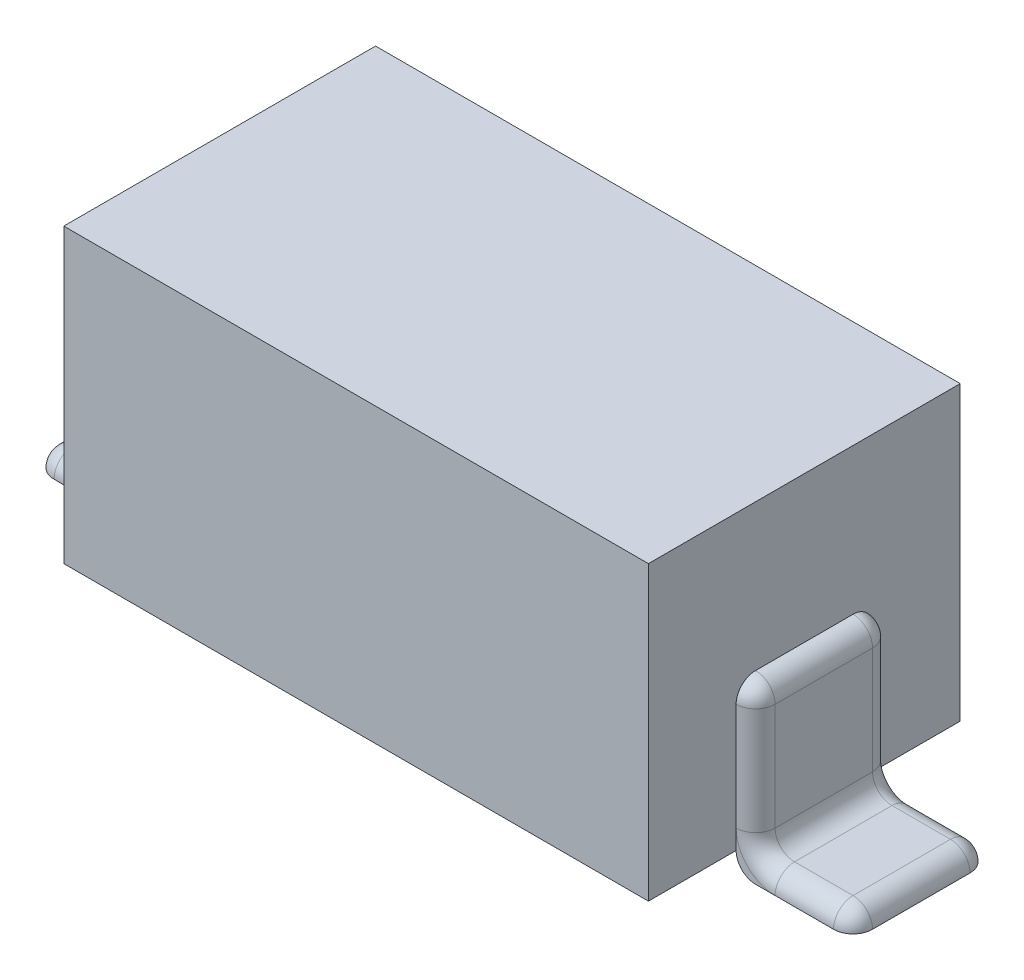
ISO-10303-21;
HEADER;
FILE_DESCRIPTION(('STEP AP214'),'2;1');
FILE_NAME('part.step','',(''),(''),'','','');
FILE_SCHEMA(('AUTOMOTIVE_DESIGN { 1 0 10303 214 1 1 1 1 }'));
ENDSEC;
DATA;
#1=APPLICATION_CONTEXT('core data for automotive mechanical design processes');
#2=APPLICATION_PROTOCOL_DEFINITION('international standard','automotive_design',2000,#1);
#3=PRODUCT_CONTEXT('',#1,'mechanical');
#4=PRODUCT('Part','Part','',(#3));
#5=PRODUCT_RELATED_PRODUCT_CATEGORY('part','',(#4));
#6=PRODUCT_DEFINITION_FORMATION('','',#4);
#7=PRODUCT_DEFINITION_CONTEXT('part definition',#1,'design');
#8=PRODUCT_DEFINITION('design','',#6,#7);
#9=PRODUCT_DEFINITION_SHAPE('','',#8);
#10=(LENGTH_UNIT() NAMED_UNIT(*) SI_UNIT(.MILLI.,.METRE.));
#11=(NAMED_UNIT(*) PLANE_ANGLE_UNIT() SI_UNIT($,.RADIAN.));
#12=(NAMED_UNIT(*) SI_UNIT($,.STERADIAN.) SOLID_ANGLE_UNIT());
#13=UNCERTAINTY_MEASURE_WITH_UNIT(LENGTH_MEASURE(1.E-05),#10,'distance_accuracy_value','');
#14=(GEOMETRIC_REPRESENTATION_CONTEXT(3) GLOBAL_UNCERTAINTY_ASSIGNED_CONTEXT((#13)) GLOBAL_UNIT_ASSIGNED_CONTEXT((#10,
#11,#12)) REPRESENTATION_CONTEXT('',''));
#15=CARTESIAN_POINT('',(0.,0.,0.));
#16=DIRECTION('',(0.,0.,1.));
#17=DIRECTION('',(1.,0.,0.));
#18=AXIS2_PLACEMENT_3D('',#15,#16,#17);
#19=CARTESIAN_POINT('',(-1.6,-0.85,0.35));
#20=DIRECTION('',(0.,0.,1.));
#21=DIRECTION('',(1.,0.,0.));
#22=AXIS2_PLACEMENT_3D('',#19,#20,#21);
#23=PLANE('',#22);
#24=DIRECTION('',(1.,0.,0.));
#25=VECTOR('',#24,1.);
#26=CARTESIAN_POINT('',(-1.6,-0.85,0.35));
#27=LINE('',#26,#25);
#28=CARTESIAN_POINT('',(-1.7,-0.85,0.35));
#29=VERTEX_POINT('',#28);
#30=CARTESIAN_POINT('',(-1.6,-0.85,0.35));
#31=VERTEX_POINT('',#30);
#32=EDGE_CURVE('E303',#29,#31,#27,.T.);
#33=ORIENTED_EDGE('',*,*,#32,.T.);
#34=CARTESIAN_POINT('',(-1.6,-0.75,0.35));
#35=DIRECTION('',(0.,0.,1.));
#36=DIRECTION('',(1.,0.,0.));
#37=AXIS2_PLACEMENT_3D('',#34,#35,#36);
#38=CIRCLE('',#37,0.1);
#39=CARTESIAN_POINT('',(-1.5,-0.75,0.35));
#40=VERTEX_POINT('',#39);
#41=EDGE_CURVE('E374',#31,#40,#38,.T.);
#42=ORIENTED_EDGE('',*,*,#41,.T.);
#43=DIRECTION('',(0.,-1.,0.));
#44=VECTOR('',#43,1.);
#45=CARTESIAN_POINT('',(-1.5,-0.85,0.35));
#46=LINE('',#45,#44);
#47=CARTESIAN_POINT('',(-1.5,-0.65,0.35));
#48=VERTEX_POINT('',#47);
#49=EDGE_CURVE('E308',#48,#40,#46,.T.);
#50=ORIENTED_EDGE('',*,*,#49,.F.);
#51=CARTESIAN_POINT('',(-1.7,-0.65,0.35));
#52=DIRECTION('',(0.,0.,1.));
#53=DIRECTION('',(1.,0.,0.));
#54=AXIS2_PLACEMENT_3D('',#51,#52,#53);
#55=CIRCLE('',#54,0.2);
#56=EDGE_CURVE('E376',#29,#48,#55,.T.);
#57=ORIENTED_EDGE('',*,*,#56,.F.);
#58=EDGE_LOOP('',(#33,#42,#50,#57));
#59=FACE_BOUND('',#58,.T.);
#60=ADVANCED_FACE('F34',(#59),#23,.T.);
#61=CARTESIAN_POINT('',(-1.6,-0.85,-0.35));
#62=DIRECTION('',(0.,0.,-1.));
#63=DIRECTION('',(-1.,0.,0.));
#64=AXIS2_PLACEMENT_3D('',#61,#62,#63);
#65=PLANE('',#64);
#66=CARTESIAN_POINT('',(-1.7,-0.65,-0.35));
#67=DIRECTION('',(0.,0.,-1.));
#68=DIRECTION('',(-1.,0.,0.));
#69=AXIS2_PLACEMENT_3D('',#66,#67,#68);
#70=CIRCLE('',#69,0.2);
#71=CARTESIAN_POINT('',(-1.5,-0.65,-0.35));
#72=VERTEX_POINT('',#71);
#73=CARTESIAN_POINT('',(-1.7,-0.85,-0.35));
#74=VERTEX_POINT('',#73);
#75=EDGE_CURVE('E226',#72,#74,#70,.T.);
#76=ORIENTED_EDGE('',*,*,#75,.F.);
#77=DIRECTION('',(0.,1.,0.));
#78=VECTOR('',#77,1.);
#79=CARTESIAN_POINT('',(-1.5,-0.85,-0.35));
#80=LINE('',#79,#78);
#81=CARTESIAN_POINT('',(-1.5,-0.75,-0.35));
#82=VERTEX_POINT('',#81);
#83=EDGE_CURVE('E227',#82,#72,#80,.T.);
#84=ORIENTED_EDGE('',*,*,#83,.F.);
#85=CARTESIAN_POINT('',(-1.6,-0.75,-0.35));
#86=DIRECTION('',(0.,0.,-1.));
#87=DIRECTION('',(-1.,0.,0.));
#88=AXIS2_PLACEMENT_3D('',#85,#86,#87);
#89=CIRCLE('',#88,0.1);
#90=CARTESIAN_POINT('',(-1.6,-0.85,-0.35));
#91=VERTEX_POINT('',#90);
#92=EDGE_CURVE('E217',#82,#91,#89,.T.);
#93=ORIENTED_EDGE('',*,*,#92,.T.);
#94=DIRECTION('',(1.,0.,0.));
#95=VECTOR('',#94,1.);
#96=CARTESIAN_POINT('',(-1.6,-0.85,-0.35));
#97=LINE('',#96,#95);
#98=EDGE_CURVE('E299',#74,#91,#97,.T.);
#99=ORIENTED_EDGE('',*,*,#98,.F.);
#100=EDGE_LOOP('',(#76,#84,#93,#99));
#101=FACE_BOUND('',#100,.T.);
#102=ADVANCED_FACE('F230',(#101),#65,.T.);
#103=CARTESIAN_POINT('',(1.6,-0.85,0.35));
#104=DIRECTION('',(0.,0.,-1.));
#105=DIRECTION('',(-1.,0.,0.));
#106=AXIS2_PLACEMENT_3D('',#103,#104,#105);
#107=PLANE('',#106);
#108=CARTESIAN_POINT('',(1.7,-0.65,0.35));
#109=DIRECTION('',(0.,0.,-1.));
#110=DIRECTION('',(-1.,0.,0.));
#111=AXIS2_PLACEMENT_3D('',#108,#109,#110);
#112=CIRCLE('',#111,0.2);
#113=CARTESIAN_POINT('',(1.5,-0.65,0.35));
#114=VERTEX_POINT('',#113);
#115=CARTESIAN_POINT('',(1.7,-0.85,0.35));
#116=VERTEX_POINT('',#115);
#117=EDGE_CURVE('E446',#114,#116,#112,.F.);
#118=ORIENTED_EDGE('',*,*,#117,.F.);
#119=DIRECTION('',(0.,-1.,0.));
#120=VECTOR('',#119,1.);
#121=CARTESIAN_POINT('',(1.5,-0.85,0.35));
#122=LINE('',#121,#120);
#123=CARTESIAN_POINT('',(1.5,-0.75,0.35));
#124=VERTEX_POINT('',#123);
#125=EDGE_CURVE('E285',#114,#124,#122,.T.);
#126=ORIENTED_EDGE('',*,*,#125,.T.);
#127=CARTESIAN_POINT('',(1.6,-0.75,0.35));
#128=DIRECTION('',(0.,0.,-1.));
#129=DIRECTION('',(-1.,0.,0.));
#130=AXIS2_PLACEMENT_3D('',#127,#128,#129);
#131=CIRCLE('',#130,0.1);
#132=CARTESIAN_POINT('',(1.6,-0.85,0.35));
#133=VERTEX_POINT('',#132);
#134=EDGE_CURVE('E449',#124,#133,#131,.F.);
#135=ORIENTED_EDGE('',*,*,#134,.T.);
#136=DIRECTION('',(-1.,0.,0.));
#137=VECTOR('',#136,1.);
#138=CARTESIAN_POINT('',(1.6,-0.85,0.35));
#139=LINE('',#138,#137);
#140=EDGE_CURVE('E276',#116,#133,#139,.T.);
#141=ORIENTED_EDGE('',*,*,#140,.F.);
#142=EDGE_LOOP('',(#118,#126,#135,#141));
#143=FACE_BOUND('',#142,.T.);
#144=ADVANCED_FACE('F501',(#143),#107,.F.);
#145=CARTESIAN_POINT('',(1.6,-0.85,-0.35));
#146=DIRECTION('',(0.,0.,1.));
#147=DIRECTION('',(1.,0.,0.));
#148=AXIS2_PLACEMENT_3D('',#145,#146,#147);
#149=PLANE('',#148);
#150=DIRECTION('',(-1.,0.,0.));
#151=VECTOR('',#150,1.);
#152=CARTESIAN_POINT('',(1.6,-0.85,-0.35));
#153=LINE('',#152,#151);
#154=CARTESIAN_POINT('',(1.7,-0.85,-0.35));
#155=VERTEX_POINT('',#154);
#156=CARTESIAN_POINT('',(1.6,-0.85,-0.35));
#157=VERTEX_POINT('',#156);
#158=EDGE_CURVE('E281',#155,#157,#153,.T.);
#159=ORIENTED_EDGE('',*,*,#158,.T.);
#160=CARTESIAN_POINT('',(1.6,-0.75,-0.35));
#161=DIRECTION('',(0.,0.,1.));
#162=DIRECTION('',(1.,0.,0.));
#163=AXIS2_PLACEMENT_3D('',#160,#161,#162);
#164=CIRCLE('',#163,0.1);
#165=CARTESIAN_POINT('',(1.5,-0.75,-0.35));
#166=VERTEX_POINT('',#165);
#167=EDGE_CURVE('E451',#157,#166,#164,.F.);
#168=ORIENTED_EDGE('',*,*,#167,.T.);
#169=DIRECTION('',(0.,1.,0.));
#170=VECTOR('',#169,1.);
#171=CARTESIAN_POINT('',(1.5,-0.85,-0.35));
#172=LINE('',#171,#170);
#173=CARTESIAN_POINT('',(1.5,-0.65,-0.35));
#174=VERTEX_POINT('',#173);
#175=EDGE_CURVE('E294',#166,#174,#172,.T.);
#176=ORIENTED_EDGE('',*,*,#175,.T.);
#177=CARTESIAN_POINT('',(1.7,-0.65,-0.35));
#178=DIRECTION('',(0.,0.,1.));
#179=DIRECTION('',(1.,0.,0.));
#180=AXIS2_PLACEMENT_3D('',#177,#178,#179);
#181=CIRCLE('',#180,0.2);
#182=EDGE_CURVE('E453',#155,#174,#181,.F.);
#183=ORIENTED_EDGE('',*,*,#182,.F.);
#184=EDGE_LOOP('',(#159,#168,#176,#183));
#185=FACE_BOUND('',#184,.T.);
#186=ADVANCED_FACE('F525',(#185),#149,.F.);
#187=CARTESIAN_POINT('',(1.6,0.,0.));
#188=DIRECTION('',(-1.,0.,0.));
#189=DIRECTION('',(0.,0.,1.));
#190=AXIS2_PLACEMENT_3D('',#187,#188,#189);
#191=PLANE('',#190);
#192=DIRECTION('',(0.,0.,1.));
#193=VECTOR('',#192,1.);
#194=CARTESIAN_POINT('',(1.6,-0.65,-0.35));
#195=LINE('',#194,#193);
#196=CARTESIAN_POINT('',(1.6,-0.65,0.25));
#197=VERTEX_POINT('',#196);
#198=CARTESIAN_POINT('',(1.6,-0.65,-0.25));
#199=VERTEX_POINT('',#198);
#200=EDGE_CURVE('E433',#197,#199,#195,.F.);
#201=ORIENTED_EDGE('',*,*,#200,.T.);
#202=DIRECTION('',(0.,1.,0.));
#203=VECTOR('',#202,1.);
#204=CARTESIAN_POINT('',(1.6,0.,-0.25));
#205=LINE('',#204,#203);
#206=CARTESIAN_POINT('',(1.6,-0.1,-0.25));
#207=VERTEX_POINT('',#206);
#208=EDGE_CURVE('E430',#199,#207,#205,.T.);
#209=ORIENTED_EDGE('',*,*,#208,.T.);
#210=DIRECTION('',(0.,0.,1.));
#211=VECTOR('',#210,1.);
#212=CARTESIAN_POINT('',(1.6,-0.1,0.));
#213=LINE('',#212,#211);
#214=CARTESIAN_POINT('',(1.6,-0.1,0.25));
#215=VERTEX_POINT('',#214);
#216=EDGE_CURVE('E435',#207,#215,#213,.T.);
#217=ORIENTED_EDGE('',*,*,#216,.T.);
#218=DIRECTION('',(0.,-1.,0.));
#219=VECTOR('',#218,1.);
#220=CARTESIAN_POINT('',(1.6,0.,0.25));
#221=LINE('',#220,#219);
#222=EDGE_CURVE('E437',#215,#197,#221,.T.);
#223=ORIENTED_EDGE('',*,*,#222,.T.);
#224=EDGE_LOOP('',(#201,#209,#217,#223));
#225=FACE_BOUND('',#224,.T.);
#226=ADVANCED_FACE('F577',(#225),#191,.F.);
#227=CARTESIAN_POINT('',(1.5,0.75,0.8));
#228=DIRECTION('',(-1.,0.,0.));
#229=DIRECTION('',(0.,0.,1.));
#230=AXIS2_PLACEMENT_3D('',#227,#228,#229);
#231=PLANE('',#230);
#232=ORIENTED_EDGE('',*,*,#175,.F.);
#233=DIRECTION('',(0.,0.,-1.));
#234=VECTOR('',#233,1.);
#235=CARTESIAN_POINT('',(1.5,-0.75,0.8));
#236=LINE('',#235,#234);
#237=CARTESIAN_POINT('',(1.5,-0.75,-0.8));
#238=VERTEX_POINT('',#237);
#239=EDGE_CURVE('E265',#166,#238,#236,.T.);
#240=ORIENTED_EDGE('',*,*,#239,.T.);
#241=DIRECTION('',(0.,-1.,0.));
#242=VECTOR('',#241,1.);
#243=CARTESIAN_POINT('',(1.5,0.75,-0.8));
#244=LINE('',#243,#242);
#245=CARTESIAN_POINT('',(1.5,0.75,-0.8));
#246=VERTEX_POINT('',#245);
#247=EDGE_CURVE('E295',#246,#238,#244,.T.);
#248=ORIENTED_EDGE('',*,*,#247,.F.);
#249=DIRECTION('',(0.,0.,-1.));
#250=VECTOR('',#249,1.);
#251=CARTESIAN_POINT('',(1.5,0.75,0.8));
#252=LINE('',#251,#250);
#253=CARTESIAN_POINT('',(1.5,0.75,0.8));
#254=VERTEX_POINT('',#253);
#255=EDGE_CURVE('E252',#254,#246,#252,.T.);
#256=ORIENTED_EDGE('',*,*,#255,.F.);
#257=DIRECTION('',(0.,-1.,0.));
#258=VECTOR('',#257,1.);
#259=CARTESIAN_POINT('',(1.5,0.75,0.8));
#260=LINE('',#259,#258);
#261=CARTESIAN_POINT('',(1.5,-0.75,0.8));
#262=VERTEX_POINT('',#261);
#263=EDGE_CURVE('E269',#254,#262,#260,.T.);
#264=ORIENTED_EDGE('',*,*,#263,.T.);
#265=EDGE_CURVE('E259',#262,#124,#236,.T.);
#266=ORIENTED_EDGE('',*,*,#265,.T.);
#267=ORIENTED_EDGE('',*,*,#125,.F.);
#268=CARTESIAN_POINT('',(1.5,-0.1,0.35));
#269=VERTEX_POINT('',#268);
#270=EDGE_CURVE('E284',#269,#114,#122,.T.);
#271=ORIENTED_EDGE('',*,*,#270,.F.);
#272=CARTESIAN_POINT('',(1.5,-0.1,0.25));
#273=DIRECTION('',(-1.,0.,0.));
#274=DIRECTION('',(0.,0.,1.));
#275=AXIS2_PLACEMENT_3D('',#272,#273,#274);
#276=CIRCLE('',#275,0.1);
#277=CARTESIAN_POINT('',(1.5,0.,0.25));
#278=VERTEX_POINT('',#277);
#279=EDGE_CURVE('E311',#269,#278,#276,.T.);
#280=ORIENTED_EDGE('',*,*,#279,.T.);
#281=DIRECTION('',(0.,0.,1.));
#282=VECTOR('',#281,1.);
#283=CARTESIAN_POINT('',(1.5,0.,0.35));
#284=LINE('',#283,#282);
#285=CARTESIAN_POINT('',(1.5,0.,-0.25));
#286=VERTEX_POINT('',#285);
#287=EDGE_CURVE('E287',#286,#278,#284,.T.);
#288=ORIENTED_EDGE('',*,*,#287,.F.);
#289=CARTESIAN_POINT('',(1.5,-0.1,-0.25));
#290=DIRECTION('',(-1.,0.,0.));
#291=DIRECTION('',(0.,0.,1.));
#292=AXIS2_PLACEMENT_3D('',#289,#290,#291);
#293=CIRCLE('',#292,0.1);
#294=CARTESIAN_POINT('',(1.5,-0.1,-0.35));
#295=VERTEX_POINT('',#294);
#296=EDGE_CURVE('E428',#286,#295,#293,.T.);
#297=ORIENTED_EDGE('',*,*,#296,.T.);
#298=EDGE_CURVE('E291',#174,#295,#172,.T.);
#299=ORIENTED_EDGE('',*,*,#298,.F.);
#300=EDGE_LOOP('',(#232,#240,#248,#256,#264,#266,#267,#271,#280,#288,#297,#299));
#301=FACE_BOUND('',#300,.T.);
#302=ADVANCED_FACE('F474',(#301),#231,.F.);
#303=CARTESIAN_POINT('',(-1.5,0.75,-0.8));
#304=DIRECTION('',(0.,0.,1.));
#305=DIRECTION('',(1.,0.,0.));
#306=AXIS2_PLACEMENT_3D('',#303,#304,#305);
#307=PLANE('',#306);
#308=DIRECTION('',(-1.,0.,0.));
#309=VECTOR('',#308,1.);
#310=CARTESIAN_POINT('',(-1.5,-0.75,-0.8));
#311=LINE('',#310,#309);
#312=CARTESIAN_POINT('',(-1.5,-0.75,-0.8));
#313=VERTEX_POINT('',#312);
#314=EDGE_CURVE('E255',#238,#313,#311,.T.);
#315=ORIENTED_EDGE('',*,*,#314,.T.);
#316=DIRECTION('',(0.,-1.,0.));
#317=VECTOR('',#316,1.);
#318=CARTESIAN_POINT('',(-1.5,0.75,-0.8));
#319=LINE('',#318,#317);
#320=CARTESIAN_POINT('',(-1.5,0.75,-0.8));
#321=VERTEX_POINT('',#320);
#322=EDGE_CURVE('E250',#321,#313,#319,.T.);
#323=ORIENTED_EDGE('',*,*,#322,.F.);
#324=DIRECTION('',(-1.,0.,0.));
#325=VECTOR('',#324,1.);
#326=CARTESIAN_POINT('',(-1.5,0.75,-0.8));
#327=LINE('',#326,#325);
#328=EDGE_CURVE('E272',#246,#321,#327,.T.);
#329=ORIENTED_EDGE('',*,*,#328,.F.);
#330=ORIENTED_EDGE('',*,*,#247,.T.);
#331=EDGE_LOOP('',(#315,#323,#329,#330));
#332=FACE_BOUND('',#331,.T.);
#333=ADVANCED_FACE('F598',(#332),#307,.F.);
#334=CARTESIAN_POINT('',(-1.5,0.75,0.8));
#335=DIRECTION('',(1.,0.,0.));
#336=DIRECTION('',(0.,0.,-1.));
#337=AXIS2_PLACEMENT_3D('',#334,#335,#336);
#338=PLANE('',#337);
#339=DIRECTION('',(0.,0.,1.));
#340=VECTOR('',#339,1.);
#341=CARTESIAN_POINT('',(-1.5,-0.75,0.8));
#342=LINE('',#341,#340);
#343=EDGE_CURVE('E242',#313,#82,#342,.T.);
#344=ORIENTED_EDGE('',*,*,#343,.T.);
#345=ORIENTED_EDGE('',*,*,#83,.T.);
#346=CARTESIAN_POINT('',(-1.5,-0.1,-0.35));
#347=VERTEX_POINT('',#346);
#348=EDGE_CURVE('E234',#72,#347,#80,.T.);
#349=ORIENTED_EDGE('',*,*,#348,.T.);
#350=CARTESIAN_POINT('',(-1.5,-0.1,-0.25));
#351=DIRECTION('',(1.,0.,0.));
#352=DIRECTION('',(0.,0.,-1.));
#353=AXIS2_PLACEMENT_3D('',#350,#351,#352);
#354=CIRCLE('',#353,0.1);
#355=CARTESIAN_POINT('',(-1.5,0.,-0.25));
#356=VERTEX_POINT('',#355);
#357=EDGE_CURVE('E43',#347,#356,#354,.T.);
#358=ORIENTED_EDGE('',*,*,#357,.T.);
#359=DIRECTION('',(0.,0.,1.));
#360=VECTOR('',#359,1.);
#361=CARTESIAN_POINT('',(-1.5,0.,0.35));
#362=LINE('',#361,#360);
#363=CARTESIAN_POINT('',(-1.5,0.,0.25));
#364=VERTEX_POINT('',#363);
#365=EDGE_CURVE('E50',#356,#364,#362,.T.);
#366=ORIENTED_EDGE('',*,*,#365,.T.);
#367=CARTESIAN_POINT('',(-1.5,-0.1,0.25));
#368=DIRECTION('',(1.,0.,0.));
#369=DIRECTION('',(0.,0.,-1.));
#370=AXIS2_PLACEMENT_3D('',#367,#368,#369);
#371=CIRCLE('',#370,0.1);
#372=CARTESIAN_POINT('',(-1.5,-0.1,0.35));
#373=VERTEX_POINT('',#372);
#374=EDGE_CURVE('E11',#364,#373,#371,.T.);
#375=ORIENTED_EDGE('',*,*,#374,.T.);
#376=EDGE_CURVE('E307',#373,#48,#46,.T.);
#377=ORIENTED_EDGE('',*,*,#376,.T.);
#378=ORIENTED_EDGE('',*,*,#49,.T.);
#379=CARTESIAN_POINT('',(-1.5,-0.75,0.8));
#380=VERTEX_POINT('',#379);
#381=EDGE_CURVE('E244',#40,#380,#342,.T.);
#382=ORIENTED_EDGE('',*,*,#381,.T.);
#383=DIRECTION('',(0.,-1.,0.));
#384=VECTOR('',#383,1.);
#385=CARTESIAN_POINT('',(-1.5,0.75,0.8));
#386=LINE('',#385,#384);
#387=CARTESIAN_POINT('',(-1.5,0.75,0.8));
#388=VERTEX_POINT('',#387);
#389=EDGE_CURVE('E467',#388,#380,#386,.T.);
#390=ORIENTED_EDGE('',*,*,#389,.F.);
#391=DIRECTION('',(0.,0.,1.));
#392=VECTOR('',#391,1.);
#393=CARTESIAN_POINT('',(-1.5,0.75,0.8));
#394=LINE('',#393,#392);
#395=EDGE_CURVE('E270',#321,#388,#394,.T.);
#396=ORIENTED_EDGE('',*,*,#395,.F.);
#397=ORIENTED_EDGE('',*,*,#322,.T.);
#398=EDGE_LOOP('',(#344,#345,#349,#358,#366,#375,#377,#378,#382,#390,#396,#397));
#399=FACE_BOUND('',#398,.T.);
#400=ADVANCED_FACE('F247',(#399),#338,.F.);
#401=CARTESIAN_POINT('',(-1.5,0.75,0.8));
#402=DIRECTION('',(0.,0.,-1.));
#403=DIRECTION('',(-1.,0.,0.));
#404=AXIS2_PLACEMENT_3D('',#401,#402,#403);
#405=PLANE('',#404);
#406=DIRECTION('',(1.,0.,0.));
#407=VECTOR('',#406,1.);
#408=CARTESIAN_POINT('',(-1.5,-0.75,0.8));
#409=LINE('',#408,#407);
#410=EDGE_CURVE('E251',#380,#262,#409,.T.);
#411=ORIENTED_EDGE('',*,*,#410,.T.);
#412=ORIENTED_EDGE('',*,*,#263,.F.);
#413=DIRECTION('',(1.,0.,0.));
#414=VECTOR('',#413,1.);
#415=CARTESIAN_POINT('',(-1.5,0.75,0.8));
#416=LINE('',#415,#414);
#417=EDGE_CURVE('E267',#388,#254,#416,.T.);
#418=ORIENTED_EDGE('',*,*,#417,.F.);
#419=ORIENTED_EDGE('',*,*,#389,.T.);
#420=EDGE_LOOP('',(#411,#412,#418,#419));
#421=FACE_BOUND('',#420,.T.);
#422=ADVANCED_FACE('F590',(#421),#405,.F.);
#423=CARTESIAN_POINT('',(0.,0.75,0.));
#424=DIRECTION('',(0.,-1.,0.));
#425=DIRECTION('',(0.,0.,-1.));
#426=AXIS2_PLACEMENT_3D('',#423,#424,#425);
#427=PLANE('',#426);
#428=ORIENTED_EDGE('',*,*,#255,.T.);
#429=ORIENTED_EDGE('',*,*,#328,.T.);
#430=ORIENTED_EDGE('',*,*,#395,.T.);
#431=ORIENTED_EDGE('',*,*,#417,.T.);
#432=EDGE_LOOP('',(#428,#429,#430,#431));
#433=FACE_BOUND('',#432,.T.);
#434=ADVANCED_FACE('F587',(#433),#427,.F.);
#435=CARTESIAN_POINT('',(0.,-0.75,0.));
#436=DIRECTION('',(0.,-1.,0.));
#437=DIRECTION('',(0.,0.,-1.));
#438=AXIS2_PLACEMENT_3D('',#435,#436,#437);
#439=PLANE('',#438);
#440=ORIENTED_EDGE('',*,*,#265,.F.);
#441=ORIENTED_EDGE('',*,*,#410,.F.);
#442=ORIENTED_EDGE('',*,*,#381,.F.);
#443=EDGE_CURVE('E221',#82,#40,#342,.T.);
#444=ORIENTED_EDGE('',*,*,#443,.F.);
#445=ORIENTED_EDGE('',*,*,#343,.F.);
#446=ORIENTED_EDGE('',*,*,#314,.F.);
#447=ORIENTED_EDGE('',*,*,#239,.F.);
#448=EDGE_CURVE('E263',#124,#166,#236,.T.);
#449=ORIENTED_EDGE('',*,*,#448,.F.);
#450=EDGE_LOOP('',(#440,#441,#442,#444,#445,#446,#447,#449));
#451=FACE_BOUND('',#450,.T.);
#452=ADVANCED_FACE('F240',(#451),#439,.T.);
#453=CARTESIAN_POINT('',(1.6,-0.85,0.35));
#454=DIRECTION('',(0.,1.,0.));
#455=DIRECTION('',(0.,0.,1.));
#456=AXIS2_PLACEMENT_3D('',#453,#454,#455);
#457=PLANE('',#456);
#458=CARTESIAN_POINT('',(2.,-0.85,-0.35));
#459=VERTEX_POINT('',#458);
#460=EDGE_CURVE('E280',#459,#155,#153,.T.);
#461=ORIENTED_EDGE('',*,*,#460,.F.);
#462=CARTESIAN_POINT('',(2.,-0.85,-0.25));
#463=DIRECTION('',(0.,1.,0.));
#464=DIRECTION('',(0.,0.,1.));
#465=AXIS2_PLACEMENT_3D('',#462,#463,#464);
#466=CIRCLE('',#465,0.1);
#467=CARTESIAN_POINT('',(2.1,-0.85,-0.25));
#468=VERTEX_POINT('',#467);
#469=EDGE_CURVE('E439',#459,#468,#466,.F.);
#470=ORIENTED_EDGE('',*,*,#469,.T.);
#471=DIRECTION('',(0.,0.,-1.));
#472=VECTOR('',#471,1.);
#473=CARTESIAN_POINT('',(2.1,-0.85,0.35));
#474=LINE('',#473,#472);
#475=CARTESIAN_POINT('',(2.1,-0.85,0.25));
#476=VERTEX_POINT('',#475);
#477=EDGE_CURVE('E290',#476,#468,#474,.T.);
#478=ORIENTED_EDGE('',*,*,#477,.F.);
#479=CARTESIAN_POINT('',(2.,-0.85,0.25));
#480=DIRECTION('',(0.,1.,0.));
#481=DIRECTION('',(0.,0.,1.));
#482=AXIS2_PLACEMENT_3D('',#479,#480,#481);
#483=CIRCLE('',#482,0.1);
#484=CARTESIAN_POINT('',(2.,-0.85,0.35));
#485=VERTEX_POINT('',#484);
#486=EDGE_CURVE('E441',#476,#485,#483,.F.);
#487=ORIENTED_EDGE('',*,*,#486,.T.);
#488=EDGE_CURVE('E279',#485,#116,#139,.T.);
#489=ORIENTED_EDGE('',*,*,#488,.T.);
#490=ORIENTED_EDGE('',*,*,#140,.T.);
#491=DIRECTION('',(0.,0.,-1.));
#492=VECTOR('',#491,1.);
#493=CARTESIAN_POINT('',(1.6,-0.85,-0.35));
#494=LINE('',#493,#492);
#495=EDGE_CURVE('E443',#133,#157,#494,.T.);
#496=ORIENTED_EDGE('',*,*,#495,.T.);
#497=ORIENTED_EDGE('',*,*,#158,.F.);
#498=EDGE_LOOP('',(#461,#470,#478,#487,#489,#490,#496,#497));
#499=FACE_BOUND('',#498,.T.);
#500=ADVANCED_FACE('F489',(#499),#457,.F.);
#501=CARTESIAN_POINT('',(2.1,-0.75,0.35));
#502=DIRECTION('',(0.,-1.,0.));
#503=DIRECTION('',(0.,0.,-1.));
#504=AXIS2_PLACEMENT_3D('',#501,#502,#503);
#505=PLANE('',#504);
#506=DIRECTION('',(-1.,0.,0.));
#507=VECTOR('',#506,1.);
#508=CARTESIAN_POINT('',(2.1,-0.75,0.25));
#509=LINE('',#508,#507);
#510=CARTESIAN_POINT('',(1.7,-0.75,0.25));
#511=VERTEX_POINT('',#510);
#512=CARTESIAN_POINT('',(2.,-0.75,0.25));
#513=VERTEX_POINT('',#512);
#514=EDGE_CURVE('E461',#511,#513,#509,.F.);
#515=ORIENTED_EDGE('',*,*,#514,.T.);
#516=DIRECTION('',(0.,0.,1.));
#517=VECTOR('',#516,1.);
#518=CARTESIAN_POINT('',(2.,-0.75,0.35));
#519=LINE('',#518,#517);
#520=CARTESIAN_POINT('',(2.,-0.75,-0.25));
#521=VERTEX_POINT('',#520);
#522=EDGE_CURVE('E456',#513,#521,#519,.F.);
#523=ORIENTED_EDGE('',*,*,#522,.T.);
#524=DIRECTION('',(-1.,0.,0.));
#525=VECTOR('',#524,1.);
#526=CARTESIAN_POINT('',(2.1,-0.75,-0.25));
#527=LINE('',#526,#525);
#528=CARTESIAN_POINT('',(1.7,-0.75,-0.25));
#529=VERTEX_POINT('',#528);
#530=EDGE_CURVE('E458',#521,#529,#527,.T.);
#531=ORIENTED_EDGE('',*,*,#530,.T.);
#532=DIRECTION('',(0.,0.,1.));
#533=VECTOR('',#532,1.);
#534=CARTESIAN_POINT('',(1.7,-0.75,0.35));
#535=LINE('',#534,#533);
#536=EDGE_CURVE('E463',#529,#511,#535,.T.);
#537=ORIENTED_EDGE('',*,*,#536,.T.);
#538=EDGE_LOOP('',(#515,#523,#531,#537));
#539=FACE_BOUND('',#538,.T.);
#540=ADVANCED_FACE('F543',(#539),#505,.F.);
#541=CARTESIAN_POINT('',(1.5,-0.1,0.25));
#542=DIRECTION('',(0.,0.,1.));
#543=DIRECTION('',(1.,0.,0.));
#544=AXIS2_PLACEMENT_3D('',#541,#542,#543);
#545=SPHERICAL_SURFACE('',#544,0.1);
#546=CARTESIAN_POINT('',(1.5,-0.1,0.25));
#547=DIRECTION('',(0.,0.,1.));
#548=DIRECTION('',(1.,0.,0.));
#549=AXIS2_PLACEMENT_3D('',#546,#547,#548);
#550=CIRCLE('',#549,0.1);
#551=EDGE_CURVE('E391',#278,#215,#550,.F.);
#552=ORIENTED_EDGE('',*,*,#551,.F.);
#553=ORIENTED_EDGE('',*,*,#279,.F.);
#554=CARTESIAN_POINT('',(1.5,-0.1,0.25));
#555=DIRECTION('',(0.,1.,0.));
#556=DIRECTION('',(-1.,0.,0.));
#557=AXIS2_PLACEMENT_3D('',#554,#555,#556);
#558=CIRCLE('',#557,0.1);
#559=EDGE_CURVE('E298',#215,#269,#558,.F.);
#560=ORIENTED_EDGE('',*,*,#559,.F.);
#561=EDGE_LOOP('',(#552,#553,#560));
#562=FACE_BOUND('',#561,.T.);
#563=ADVANCED_FACE('F510',(#562),#545,.T.);
#564=CARTESIAN_POINT('',(1.6,-0.85,0.25));
#565=DIRECTION('',(-1.,0.,0.));
#566=DIRECTION('',(0.,0.,1.));
#567=AXIS2_PLACEMENT_3D('',#564,#565,#566);
#568=CYLINDRICAL_SURFACE('',#567,0.1);
#569=CARTESIAN_POINT('',(1.7,-0.85,0.25));
#570=DIRECTION('',(-1.,0.,0.));
#571=DIRECTION('',(0.,0.,1.));
#572=AXIS2_PLACEMENT_3D('',#569,#570,#571);
#573=CIRCLE('',#572,0.1);
#574=EDGE_CURVE('E397',#116,#511,#573,.T.);
#575=ORIENTED_EDGE('',*,*,#574,.F.);
#576=ORIENTED_EDGE('',*,*,#488,.F.);
#577=CARTESIAN_POINT('',(2.,-0.85,0.25));
#578=DIRECTION('',(1.,0.,0.));
#579=DIRECTION('',(0.,0.,-1.));
#580=AXIS2_PLACEMENT_3D('',#577,#578,#579);
#581=CIRCLE('',#580,0.1);
#582=EDGE_CURVE('E394',#513,#485,#581,.T.);
#583=ORIENTED_EDGE('',*,*,#582,.F.);
#584=ORIENTED_EDGE('',*,*,#514,.F.);
#585=EDGE_LOOP('',(#575,#576,#583,#584));
#586=FACE_BOUND('',#585,.T.);
#587=ADVANCED_FACE('F495',(#586),#568,.T.);
#588=CARTESIAN_POINT('',(1.5,0.,0.25));
#589=DIRECTION('',(0.,-1.,0.));
#590=DIRECTION('',(0.,0.,-1.));
#591=AXIS2_PLACEMENT_3D('',#588,#589,#590);
#592=CYLINDRICAL_SURFACE('',#591,0.1);
#593=ORIENTED_EDGE('',*,*,#559,.T.);
#594=ORIENTED_EDGE('',*,*,#270,.T.);
#595=CARTESIAN_POINT('',(1.5,-0.65,0.25));
#596=DIRECTION('',(0.,-1.,0.));
#597=DIRECTION('',(0.,0.,-1.));
#598=AXIS2_PLACEMENT_3D('',#595,#596,#597);
#599=CIRCLE('',#598,0.1);
#600=EDGE_CURVE('E400',#197,#114,#599,.T.);
#601=ORIENTED_EDGE('',*,*,#600,.F.);
#602=ORIENTED_EDGE('',*,*,#222,.F.);
#603=EDGE_LOOP('',(#593,#594,#601,#602));
#604=FACE_BOUND('',#603,.T.);
#605=ADVANCED_FACE('F505',(#604),#592,.T.);
#606=CARTESIAN_POINT('',(1.5,-0.1,0.));
#607=DIRECTION('',(0.,0.,1.));
#608=DIRECTION('',(1.,0.,0.));
#609=AXIS2_PLACEMENT_3D('',#606,#607,#608);
#610=CYLINDRICAL_SURFACE('',#609,0.1);
#611=ORIENTED_EDGE('',*,*,#551,.T.);
#612=ORIENTED_EDGE('',*,*,#216,.F.);
#613=CARTESIAN_POINT('',(1.5,-0.1,-0.25));
#614=DIRECTION('',(0.,0.,-1.));
#615=DIRECTION('',(-1.,0.,0.));
#616=AXIS2_PLACEMENT_3D('',#613,#614,#615);
#617=CIRCLE('',#616,0.1);
#618=EDGE_CURVE('E403',#286,#207,#617,.T.);
#619=ORIENTED_EDGE('',*,*,#618,.F.);
#620=ORIENTED_EDGE('',*,*,#287,.T.);
#621=EDGE_LOOP('',(#611,#612,#619,#620));
#622=FACE_BOUND('',#621,.T.);
#623=ADVANCED_FACE('F516',(#622),#610,.T.);
#624=CARTESIAN_POINT('',(2.,-0.85,0.25));
#625=DIRECTION('',(0.,0.,1.));
#626=DIRECTION('',(1.,0.,0.));
#627=AXIS2_PLACEMENT_3D('',#624,#625,#626);
#628=SPHERICAL_SURFACE('',#627,0.1);
#629=ORIENTED_EDGE('',*,*,#582,.T.);
#630=ORIENTED_EDGE('',*,*,#486,.F.);
#631=CARTESIAN_POINT('',(2.,-0.85,0.25));
#632=DIRECTION('',(0.,0.,1.));
#633=DIRECTION('',(1.,0.,0.));
#634=AXIS2_PLACEMENT_3D('',#631,#632,#633);
#635=CIRCLE('',#634,0.1);
#636=EDGE_CURVE('E406',#513,#476,#635,.F.);
#637=ORIENTED_EDGE('',*,*,#636,.F.);
#638=EDGE_LOOP('',(#629,#630,#637));
#639=FACE_BOUND('',#638,.T.);
#640=ADVANCED_FACE('F552',(#639),#628,.T.);
#641=CARTESIAN_POINT('',(1.7,-0.65,0.25));
#642=DIRECTION('',(0.,0.,-1.));
#643=DIRECTION('',(-1.,0.,0.));
#644=AXIS2_PLACEMENT_3D('',#641,#642,#643);
#645=TOROIDAL_SURFACE('',#644,0.2,0.1);
#646=ORIENTED_EDGE('',*,*,#117,.T.);
#647=ORIENTED_EDGE('',*,*,#574,.T.);
#648=CARTESIAN_POINT('',(1.7,-0.65,0.25));
#649=DIRECTION('',(0.,0.,-1.));
#650=DIRECTION('',(-1.,0.,0.));
#651=AXIS2_PLACEMENT_3D('',#648,#649,#650);
#652=CIRCLE('',#651,0.1);
#653=EDGE_CURVE('E409',#197,#511,#652,.F.);
#654=ORIENTED_EDGE('',*,*,#653,.F.);
#655=ORIENTED_EDGE('',*,*,#600,.T.);
#656=EDGE_LOOP('',(#646,#647,#654,#655));
#657=FACE_BOUND('',#656,.T.);
#658=ADVANCED_FACE('F498',(#657),#645,.T.);
#659=CARTESIAN_POINT('',(1.5,-0.1,-0.25));
#660=DIRECTION('',(0.,0.,1.));
#661=DIRECTION('',(1.,0.,0.));
#662=AXIS2_PLACEMENT_3D('',#659,#660,#661);
#663=SPHERICAL_SURFACE('',#662,0.1);
#664=ORIENTED_EDGE('',*,*,#296,.F.);
#665=ORIENTED_EDGE('',*,*,#618,.T.);
#666=CARTESIAN_POINT('',(1.5,-0.1,-0.25));
#667=DIRECTION('',(0.,1.,0.));
#668=DIRECTION('',(0.,0.,1.));
#669=AXIS2_PLACEMENT_3D('',#666,#667,#668);
#670=CIRCLE('',#669,0.1);
#671=EDGE_CURVE('E412',#295,#207,#670,.F.);
#672=ORIENTED_EDGE('',*,*,#671,.F.);
#673=EDGE_LOOP('',(#664,#665,#672));
#674=FACE_BOUND('',#673,.T.);
#675=ADVANCED_FACE('F518',(#674),#663,.T.);
#676=CARTESIAN_POINT('',(2.,-0.85,0.));
#677=DIRECTION('',(0.,0.,1.));
#678=DIRECTION('',(1.,0.,0.));
#679=AXIS2_PLACEMENT_3D('',#676,#677,#678);
#680=CYLINDRICAL_SURFACE('',#679,0.1);
#681=ORIENTED_EDGE('',*,*,#636,.T.);
#682=ORIENTED_EDGE('',*,*,#477,.T.);
#683=CARTESIAN_POINT('',(2.,-0.85,-0.25));
#684=DIRECTION('',(0.,0.,-1.));
#685=DIRECTION('',(-1.,0.,0.));
#686=AXIS2_PLACEMENT_3D('',#683,#684,#685);
#687=CIRCLE('',#686,0.1);
#688=EDGE_CURVE('E414',#521,#468,#687,.T.);
#689=ORIENTED_EDGE('',*,*,#688,.F.);
#690=ORIENTED_EDGE('',*,*,#522,.F.);
#691=EDGE_LOOP('',(#681,#682,#689,#690));
#692=FACE_BOUND('',#691,.T.);
#693=ADVANCED_FACE('F547',(#692),#680,.T.);
#694=CARTESIAN_POINT('',(1.7,-0.65,0.35));
#695=DIRECTION('',(0.,0.,-1.));
#696=DIRECTION('',(-1.,0.,0.));
#697=AXIS2_PLACEMENT_3D('',#694,#695,#696);
#698=CYLINDRICAL_SURFACE('',#697,0.1);
#699=ORIENTED_EDGE('',*,*,#653,.T.);
#700=ORIENTED_EDGE('',*,*,#536,.F.);
#701=CARTESIAN_POINT('',(1.7,-0.65,-0.25));
#702=DIRECTION('',(0.,0.,1.));
#703=DIRECTION('',(1.,0.,0.));
#704=AXIS2_PLACEMENT_3D('',#701,#702,#703);
#705=CIRCLE('',#704,0.1);
#706=EDGE_CURVE('E417',#199,#529,#705,.T.);
#707=ORIENTED_EDGE('',*,*,#706,.F.);
#708=ORIENTED_EDGE('',*,*,#200,.F.);
#709=EDGE_LOOP('',(#699,#700,#707,#708));
#710=FACE_BOUND('',#709,.T.);
#711=ADVANCED_FACE('F541',(#710),#698,.F.);
#712=CARTESIAN_POINT('',(1.5,0.,-0.25));
#713=DIRECTION('',(0.,1.,0.));
#714=DIRECTION('',(0.,0.,1.));
#715=AXIS2_PLACEMENT_3D('',#712,#713,#714);
#716=CYLINDRICAL_SURFACE('',#715,0.1);
#717=ORIENTED_EDGE('',*,*,#671,.T.);
#718=ORIENTED_EDGE('',*,*,#208,.F.);
#719=CARTESIAN_POINT('',(1.5,-0.65,-0.25));
#720=DIRECTION('',(0.,-1.,0.));
#721=DIRECTION('',(0.,0.,-1.));
#722=AXIS2_PLACEMENT_3D('',#719,#720,#721);
#723=CIRCLE('',#722,0.1);
#724=EDGE_CURVE('E420',#174,#199,#723,.T.);
#725=ORIENTED_EDGE('',*,*,#724,.F.);
#726=ORIENTED_EDGE('',*,*,#298,.T.);
#727=EDGE_LOOP('',(#717,#718,#725,#726));
#728=FACE_BOUND('',#727,.T.);
#729=ADVANCED_FACE('F522',(#728),#716,.T.);
#730=CARTESIAN_POINT('',(2.,-0.85,-0.25));
#731=DIRECTION('',(0.,0.,1.));
#732=DIRECTION('',(1.,0.,0.));
#733=AXIS2_PLACEMENT_3D('',#730,#731,#732);
#734=SPHERICAL_SURFACE('',#733,0.1);
#735=ORIENTED_EDGE('',*,*,#688,.T.);
#736=ORIENTED_EDGE('',*,*,#469,.F.);
#737=CARTESIAN_POINT('',(2.,-0.85,-0.25));
#738=DIRECTION('',(1.,0.,0.));
#739=DIRECTION('',(0.,0.,-1.));
#740=AXIS2_PLACEMENT_3D('',#737,#738,#739);
#741=CIRCLE('',#740,0.1);
#742=EDGE_CURVE('E423',#521,#459,#741,.F.);
#743=ORIENTED_EDGE('',*,*,#742,.F.);
#744=EDGE_LOOP('',(#735,#736,#743));
#745=FACE_BOUND('',#744,.T.);
#746=ADVANCED_FACE('F549',(#745),#734,.T.);
#747=CARTESIAN_POINT('',(1.7,-0.65,-0.25));
#748=DIRECTION('',(0.,0.,1.));
#749=DIRECTION('',(1.,0.,0.));
#750=AXIS2_PLACEMENT_3D('',#747,#748,#749);
#751=TOROIDAL_SURFACE('',#750,0.2,0.1);
#752=ORIENTED_EDGE('',*,*,#724,.T.);
#753=ORIENTED_EDGE('',*,*,#706,.T.);
#754=CARTESIAN_POINT('',(1.7,-0.85,-0.25));
#755=DIRECTION('',(-1.,0.,0.));
#756=DIRECTION('',(0.,0.,1.));
#757=AXIS2_PLACEMENT_3D('',#754,#755,#756);
#758=CIRCLE('',#757,0.1);
#759=EDGE_CURVE('E425',#155,#529,#758,.F.);
#760=ORIENTED_EDGE('',*,*,#759,.F.);
#761=ORIENTED_EDGE('',*,*,#182,.T.);
#762=EDGE_LOOP('',(#752,#753,#760,#761));
#763=FACE_BOUND('',#762,.T.);
#764=ADVANCED_FACE('F536',(#763),#751,.T.);
#765=CARTESIAN_POINT('',(2.1,-0.85,-0.25));
#766=DIRECTION('',(-1.,0.,0.));
#767=DIRECTION('',(0.,0.,1.));
#768=AXIS2_PLACEMENT_3D('',#765,#766,#767);
#769=CYLINDRICAL_SURFACE('',#768,0.1);
#770=ORIENTED_EDGE('',*,*,#742,.T.);
#771=ORIENTED_EDGE('',*,*,#460,.T.);
#772=ORIENTED_EDGE('',*,*,#759,.T.);
#773=ORIENTED_EDGE('',*,*,#530,.F.);
#774=EDGE_LOOP('',(#770,#771,#772,#773));
#775=FACE_BOUND('',#774,.T.);
#776=ADVANCED_FACE('F531',(#775),#769,.T.);
#777=CARTESIAN_POINT('',(1.6,-0.75,0.35));
#778=DIRECTION('',(0.,0.,1.));
#779=DIRECTION('',(1.,0.,0.));
#780=AXIS2_PLACEMENT_3D('',#777,#778,#779);
#781=CYLINDRICAL_SURFACE('',#780,0.1);
#782=ORIENTED_EDGE('',*,*,#134,.F.);
#783=ORIENTED_EDGE('',*,*,#448,.T.);
#784=ORIENTED_EDGE('',*,*,#167,.F.);
#785=ORIENTED_EDGE('',*,*,#495,.F.);
#786=EDGE_LOOP('',(#782,#783,#784,#785));
#787=FACE_BOUND('',#786,.T.);
#788=ADVANCED_FACE('F527',(#787),#781,.T.);
#789=CARTESIAN_POINT('',(-1.6,-0.85,0.35));
#790=DIRECTION('',(0.,-1.,0.));
#791=DIRECTION('',(0.,0.,-1.));
#792=AXIS2_PLACEMENT_3D('',#789,#790,#791);
#793=PLANE('',#792);
#794=DIRECTION('',(0.,0.,-1.));
#795=VECTOR('',#794,1.);
#796=CARTESIAN_POINT('',(-2.1,-0.85,0.35));
#797=LINE('',#796,#795);
#798=CARTESIAN_POINT('',(-2.1,-0.85,0.25));
#799=VERTEX_POINT('',#798);
#800=CARTESIAN_POINT('',(-2.1,-0.85,-0.25));
#801=VERTEX_POINT('',#800);
#802=EDGE_CURVE('E309',#799,#801,#797,.T.);
#803=ORIENTED_EDGE('',*,*,#802,.T.);
#804=CARTESIAN_POINT('',(-2.,-0.85,-0.25));
#805=DIRECTION('',(0.,-1.,0.));
#806=DIRECTION('',(0.,0.,-1.));
#807=AXIS2_PLACEMENT_3D('',#804,#805,#806);
#808=CIRCLE('',#807,0.1);
#809=CARTESIAN_POINT('',(-2.,-0.85,-0.35));
#810=VERTEX_POINT('',#809);
#811=EDGE_CURVE('E369',#801,#810,#808,.T.);
#812=ORIENTED_EDGE('',*,*,#811,.T.);
#813=EDGE_CURVE('E301',#810,#74,#97,.T.);
#814=ORIENTED_EDGE('',*,*,#813,.T.);
#815=ORIENTED_EDGE('',*,*,#98,.T.);
#816=DIRECTION('',(0.,0.,-1.));
#817=VECTOR('',#816,1.);
#818=CARTESIAN_POINT('',(-1.6,-0.85,0.35));
#819=LINE('',#818,#817);
#820=EDGE_CURVE('E222',#91,#31,#819,.F.);
#821=ORIENTED_EDGE('',*,*,#820,.T.);
#822=ORIENTED_EDGE('',*,*,#32,.F.);
#823=CARTESIAN_POINT('',(-2.,-0.85,0.35));
#824=VERTEX_POINT('',#823);
#825=EDGE_CURVE('E302',#824,#29,#27,.T.);
#826=ORIENTED_EDGE('',*,*,#825,.F.);
#827=CARTESIAN_POINT('',(-2.,-0.85,0.25));
#828=DIRECTION('',(0.,-1.,0.));
#829=DIRECTION('',(0.,0.,-1.));
#830=AXIS2_PLACEMENT_3D('',#827,#828,#829);
#831=CIRCLE('',#830,0.1);
#832=EDGE_CURVE('E371',#824,#799,#831,.T.);
#833=ORIENTED_EDGE('',*,*,#832,.T.);
#834=EDGE_LOOP('',(#803,#812,#814,#815,#821,#822,#826,#833));
#835=FACE_BOUND('',#834,.T.);
#836=ADVANCED_FACE('F572',(#835),#793,.T.);
#837=CARTESIAN_POINT('',(-1.6,0.,0.));
#838=DIRECTION('',(1.,0.,0.));
#839=DIRECTION('',(0.,0.,1.));
#840=AXIS2_PLACEMENT_3D('',#837,#838,#839);
#841=PLANE('',#840);
#842=DIRECTION('',(0.,0.,1.));
#843=VECTOR('',#842,1.);
#844=CARTESIAN_POINT('',(-1.6,-0.1,-0.35));
#845=LINE('',#844,#843);
#846=CARTESIAN_POINT('',(-1.6,-0.1,0.25));
#847=VERTEX_POINT('',#846);
#848=CARTESIAN_POINT('',(-1.6,-0.1,-0.25));
#849=VERTEX_POINT('',#848);
#850=EDGE_CURVE('E365',#847,#849,#845,.F.);
#851=ORIENTED_EDGE('',*,*,#850,.T.);
#852=DIRECTION('',(0.,1.,0.));
#853=VECTOR('',#852,1.);
#854=CARTESIAN_POINT('',(-1.6,-0.75,-0.25));
#855=LINE('',#854,#853);
#856=CARTESIAN_POINT('',(-1.6,-0.65,-0.25));
#857=VERTEX_POINT('',#856);
#858=EDGE_CURVE('E360',#849,#857,#855,.F.);
#859=ORIENTED_EDGE('',*,*,#858,.T.);
#860=DIRECTION('',(0.,0.,1.));
#861=VECTOR('',#860,1.);
#862=CARTESIAN_POINT('',(-1.6,-0.65,0.));
#863=LINE('',#862,#861);
#864=CARTESIAN_POINT('',(-1.6,-0.65,0.25));
#865=VERTEX_POINT('',#864);
#866=EDGE_CURVE('E363',#857,#865,#863,.T.);
#867=ORIENTED_EDGE('',*,*,#866,.T.);
#868=DIRECTION('',(0.,-1.,0.));
#869=VECTOR('',#868,1.);
#870=CARTESIAN_POINT('',(-1.6,0.,0.25));
#871=LINE('',#870,#869);
#872=EDGE_CURVE('E367',#865,#847,#871,.F.);
#873=ORIENTED_EDGE('',*,*,#872,.T.);
#874=EDGE_LOOP('',(#851,#859,#867,#873));
#875=FACE_BOUND('',#874,.T.);
#876=ADVANCED_FACE('F570',(#875),#841,.F.);
#877=CARTESIAN_POINT('',(-2.1,-0.75,0.35));
#878=DIRECTION('',(0.,1.,0.));
#879=DIRECTION('',(0.,0.,1.));
#880=AXIS2_PLACEMENT_3D('',#877,#878,#879);
#881=PLANE('',#880);
#882=DIRECTION('',(1.,0.,0.));
#883=VECTOR('',#882,1.);
#884=CARTESIAN_POINT('',(-2.1,-0.75,-0.25));
#885=LINE('',#884,#883);
#886=CARTESIAN_POINT('',(-1.7,-0.75,-0.25));
#887=VERTEX_POINT('',#886);
#888=CARTESIAN_POINT('',(-2.,-0.75,-0.25));
#889=VERTEX_POINT('',#888);
#890=EDGE_CURVE('E381',#887,#889,#885,.F.);
#891=ORIENTED_EDGE('',*,*,#890,.T.);
#892=DIRECTION('',(0.,0.,1.));
#893=VECTOR('',#892,1.);
#894=CARTESIAN_POINT('',(-2.,-0.75,0.35));
#895=LINE('',#894,#893);
#896=CARTESIAN_POINT('',(-2.,-0.75,0.25));
#897=VERTEX_POINT('',#896);
#898=EDGE_CURVE('E379',#889,#897,#895,.T.);
#899=ORIENTED_EDGE('',*,*,#898,.T.);
#900=DIRECTION('',(1.,0.,0.));
#901=VECTOR('',#900,1.);
#902=CARTESIAN_POINT('',(-2.1,-0.75,0.25));
#903=LINE('',#902,#901);
#904=CARTESIAN_POINT('',(-1.7,-0.75,0.25));
#905=VERTEX_POINT('',#904);
#906=EDGE_CURVE('E384',#897,#905,#903,.T.);
#907=ORIENTED_EDGE('',*,*,#906,.T.);
#908=DIRECTION('',(0.,0.,1.));
#909=VECTOR('',#908,1.);
#910=CARTESIAN_POINT('',(-1.7,-0.75,0.35));
#911=LINE('',#910,#909);
#912=EDGE_CURVE('E386',#905,#887,#911,.F.);
#913=ORIENTED_EDGE('',*,*,#912,.T.);
#914=EDGE_LOOP('',(#891,#899,#907,#913));
#915=FACE_BOUND('',#914,.T.);
#916=ADVANCED_FACE('F662',(#915),#881,.T.);
#917=CARTESIAN_POINT('',(-1.5,-0.1,0.25));
#918=DIRECTION('',(0.,0.,1.));
#919=DIRECTION('',(1.,0.,0.));
#920=AXIS2_PLACEMENT_3D('',#917,#918,#919);
#921=SPHERICAL_SURFACE('',#920,0.1);
#922=CARTESIAN_POINT('',(-1.5,-0.1,0.25));
#923=DIRECTION('',(0.,1.,0.));
#924=DIRECTION('',(0.,0.,1.));
#925=AXIS2_PLACEMENT_3D('',#922,#923,#924);
#926=CIRCLE('',#925,0.1);
#927=EDGE_CURVE('E316',#373,#847,#926,.F.);
#928=ORIENTED_EDGE('',*,*,#927,.F.);
#929=ORIENTED_EDGE('',*,*,#374,.F.);
#930=CARTESIAN_POINT('',(-1.5,-0.1,0.25));
#931=DIRECTION('',(0.,0.,1.));
#932=DIRECTION('',(1.,0.,0.));
#933=AXIS2_PLACEMENT_3D('',#930,#931,#932);
#934=CIRCLE('',#933,0.1);
#935=EDGE_CURVE('E38',#847,#364,#934,.F.);
#936=ORIENTED_EDGE('',*,*,#935,.F.);
#937=EDGE_LOOP('',(#928,#929,#936));
#938=FACE_BOUND('',#937,.T.);
#939=ADVANCED_FACE('F669',(#938),#921,.T.);
#940=CARTESIAN_POINT('',(-1.5,-0.1,0.35));
#941=DIRECTION('',(0.,0.,-1.));
#942=DIRECTION('',(-1.,0.,0.));
#943=AXIS2_PLACEMENT_3D('',#940,#941,#942);
#944=CYLINDRICAL_SURFACE('',#943,0.1);
#945=ORIENTED_EDGE('',*,*,#935,.T.);
#946=ORIENTED_EDGE('',*,*,#365,.F.);
#947=CARTESIAN_POINT('',(-1.5,-0.1,-0.25));
#948=DIRECTION('',(0.,0.,-1.));
#949=DIRECTION('',(-1.,0.,0.));
#950=AXIS2_PLACEMENT_3D('',#947,#948,#949);
#951=CIRCLE('',#950,0.1);
#952=EDGE_CURVE('E327',#849,#356,#951,.T.);
#953=ORIENTED_EDGE('',*,*,#952,.F.);
#954=ORIENTED_EDGE('',*,*,#850,.F.);
#955=EDGE_LOOP('',(#945,#946,#953,#954));
#956=FACE_BOUND('',#955,.T.);
#957=ADVANCED_FACE('F676',(#956),#944,.T.);
#958=CARTESIAN_POINT('',(-1.5,-0.85,0.25));
#959=DIRECTION('',(0.,1.,0.));
#960=DIRECTION('',(0.,0.,1.));
#961=AXIS2_PLACEMENT_3D('',#958,#959,#960);
#962=CYLINDRICAL_SURFACE('',#961,0.1);
#963=ORIENTED_EDGE('',*,*,#927,.T.);
#964=ORIENTED_EDGE('',*,*,#872,.F.);
#965=CARTESIAN_POINT('',(-1.5,-0.65,0.25));
#966=DIRECTION('',(0.,-1.,0.));
#967=DIRECTION('',(0.,0.,-1.));
#968=AXIS2_PLACEMENT_3D('',#965,#966,#967);
#969=CIRCLE('',#968,0.1);
#970=EDGE_CURVE('E332',#48,#865,#969,.T.);
#971=ORIENTED_EDGE('',*,*,#970,.F.);
#972=ORIENTED_EDGE('',*,*,#376,.F.);
#973=EDGE_LOOP('',(#963,#964,#971,#972));
#974=FACE_BOUND('',#973,.T.);
#975=ADVANCED_FACE('F685',(#974),#962,.T.);
#976=CARTESIAN_POINT('',(-2.1,-0.85,0.25));
#977=DIRECTION('',(1.,0.,0.));
#978=DIRECTION('',(0.,0.,-1.));
#979=AXIS2_PLACEMENT_3D('',#976,#977,#978);
#980=CYLINDRICAL_SURFACE('',#979,0.1);
#981=CARTESIAN_POINT('',(-2.,-0.85,0.25));
#982=DIRECTION('',(-1.,0.,0.));
#983=DIRECTION('',(0.,0.,1.));
#984=AXIS2_PLACEMENT_3D('',#981,#982,#983);
#985=CIRCLE('',#984,0.1);
#986=EDGE_CURVE('E321',#824,#897,#985,.T.);
#987=ORIENTED_EDGE('',*,*,#986,.F.);
#988=ORIENTED_EDGE('',*,*,#825,.T.);
#989=CARTESIAN_POINT('',(-1.7,-0.85,0.25));
#990=DIRECTION('',(1.,0.,0.));
#991=DIRECTION('',(0.,0.,-1.));
#992=AXIS2_PLACEMENT_3D('',#989,#990,#991);
#993=CIRCLE('',#992,0.1);
#994=EDGE_CURVE('E335',#905,#29,#993,.T.);
#995=ORIENTED_EDGE('',*,*,#994,.F.);
#996=ORIENTED_EDGE('',*,*,#906,.F.);
#997=EDGE_LOOP('',(#987,#988,#995,#996));
#998=FACE_BOUND('',#997,.T.);
#999=ADVANCED_FACE('F693',(#998),#980,.T.);
#1000=CARTESIAN_POINT('',(-2.,-0.85,0.25));
#1001=DIRECTION('',(0.,0.,1.));
#1002=DIRECTION('',(1.,0.,0.));
#1003=AXIS2_PLACEMENT_3D('',#1000,#1001,#1002);
#1004=SPHERICAL_SURFACE('',#1003,0.1);
#1005=ORIENTED_EDGE('',*,*,#832,.F.);
#1006=ORIENTED_EDGE('',*,*,#986,.T.);
#1007=CARTESIAN_POINT('',(-2.,-0.85,0.25));
#1008=DIRECTION('',(0.,0.,1.));
#1009=DIRECTION('',(1.,0.,0.));
#1010=AXIS2_PLACEMENT_3D('',#1007,#1008,#1009);
#1011=CIRCLE('',#1010,0.1);
#1012=EDGE_CURVE('E338',#799,#897,#1011,.F.);
#1013=ORIENTED_EDGE('',*,*,#1012,.F.);
#1014=EDGE_LOOP('',(#1005,#1006,#1013));
#1015=FACE_BOUND('',#1014,.T.);
#1016=ADVANCED_FACE('F700',(#1015),#1004,.T.);
#1017=CARTESIAN_POINT('',(-1.5,-0.1,-0.25));
#1018=DIRECTION('',(0.,0.,1.));
#1019=DIRECTION('',(1.,0.,0.));
#1020=AXIS2_PLACEMENT_3D('',#1017,#1018,#1019);
#1021=SPHERICAL_SURFACE('',#1020,0.1);
#1022=ORIENTED_EDGE('',*,*,#952,.T.);
#1023=ORIENTED_EDGE('',*,*,#357,.F.);
#1024=CARTESIAN_POINT('',(-1.5,-0.1,-0.25));
#1025=DIRECTION('',(0.,1.,0.));
#1026=DIRECTION('',(-1.,0.,0.));
#1027=AXIS2_PLACEMENT_3D('',#1024,#1025,#1026);
#1028=CIRCLE('',#1027,0.1);
#1029=EDGE_CURVE('E341',#849,#347,#1028,.F.);
#1030=ORIENTED_EDGE('',*,*,#1029,.F.);
#1031=EDGE_LOOP('',(#1022,#1023,#1030));
#1032=FACE_BOUND('',#1031,.T.);
#1033=ADVANCED_FACE('F707',(#1032),#1021,.T.);
#1034=CARTESIAN_POINT('',(-1.7,-0.65,0.25));
#1035=DIRECTION('',(0.,0.,1.));
#1036=DIRECTION('',(1.,0.,0.));
#1037=AXIS2_PLACEMENT_3D('',#1034,#1035,#1036);
#1038=TOROIDAL_SURFACE('',#1037,0.2,0.1);
#1039=ORIENTED_EDGE('',*,*,#56,.T.);
#1040=ORIENTED_EDGE('',*,*,#970,.T.);
#1041=CARTESIAN_POINT('',(-1.7,-0.65,0.25));
#1042=DIRECTION('',(0.,0.,1.));
#1043=DIRECTION('',(1.,0.,0.));
#1044=AXIS2_PLACEMENT_3D('',#1041,#1042,#1043);
#1045=CIRCLE('',#1044,0.1);
#1046=EDGE_CURVE('E344',#905,#865,#1045,.T.);
#1047=ORIENTED_EDGE('',*,*,#1046,.F.);
#1048=ORIENTED_EDGE('',*,*,#994,.T.);
#1049=EDGE_LOOP('',(#1039,#1040,#1047,#1048));
#1050=FACE_BOUND('',#1049,.T.);
#1051=ADVANCED_FACE('F715',(#1050),#1038,.T.);
#1052=CARTESIAN_POINT('',(-2.,-0.85,0.35));
#1053=DIRECTION('',(0.,0.,-1.));
#1054=DIRECTION('',(-1.,0.,0.));
#1055=AXIS2_PLACEMENT_3D('',#1052,#1053,#1054);
#1056=CYLINDRICAL_SURFACE('',#1055,0.1);
#1057=ORIENTED_EDGE('',*,*,#1012,.T.);
#1058=ORIENTED_EDGE('',*,*,#898,.F.);
#1059=CARTESIAN_POINT('',(-2.,-0.85,-0.25));
#1060=DIRECTION('',(0.,0.,-1.));
#1061=DIRECTION('',(-1.,0.,0.));
#1062=AXIS2_PLACEMENT_3D('',#1059,#1060,#1061);
#1063=CIRCLE('',#1062,0.1);
#1064=EDGE_CURVE('E347',#801,#889,#1063,.T.);
#1065=ORIENTED_EDGE('',*,*,#1064,.F.);
#1066=ORIENTED_EDGE('',*,*,#802,.F.);
#1067=EDGE_LOOP('',(#1057,#1058,#1065,#1066));
#1068=FACE_BOUND('',#1067,.T.);
#1069=ADVANCED_FACE('F723',(#1068),#1056,.T.);
#1070=CARTESIAN_POINT('',(-1.5,-0.85,-0.25));
#1071=DIRECTION('',(0.,-1.,0.));
#1072=DIRECTION('',(0.,0.,-1.));
#1073=AXIS2_PLACEMENT_3D('',#1070,#1071,#1072);
#1074=CYLINDRICAL_SURFACE('',#1073,0.1);
#1075=ORIENTED_EDGE('',*,*,#1029,.T.);
#1076=ORIENTED_EDGE('',*,*,#348,.F.);
#1077=CARTESIAN_POINT('',(-1.5,-0.65,-0.25));
#1078=DIRECTION('',(0.,-1.,0.));
#1079=DIRECTION('',(0.,0.,-1.));
#1080=AXIS2_PLACEMENT_3D('',#1077,#1078,#1079);
#1081=CIRCLE('',#1080,0.1);
#1082=EDGE_CURVE('E350',#857,#72,#1081,.T.);
#1083=ORIENTED_EDGE('',*,*,#1082,.F.);
#1084=ORIENTED_EDGE('',*,*,#858,.F.);
#1085=EDGE_LOOP('',(#1075,#1076,#1083,#1084));
#1086=FACE_BOUND('',#1085,.T.);
#1087=ADVANCED_FACE('F731',(#1086),#1074,.T.);
#1088=CARTESIAN_POINT('',(-1.7,-0.65,0.));
#1089=DIRECTION('',(0.,0.,1.));
#1090=DIRECTION('',(1.,0.,0.));
#1091=AXIS2_PLACEMENT_3D('',#1088,#1089,#1090);
#1092=CYLINDRICAL_SURFACE('',#1091,0.1);
#1093=ORIENTED_EDGE('',*,*,#1046,.T.);
#1094=ORIENTED_EDGE('',*,*,#866,.F.);
#1095=CARTESIAN_POINT('',(-1.7,-0.65,-0.25));
#1096=DIRECTION('',(0.,0.,-1.));
#1097=DIRECTION('',(-1.,0.,0.));
#1098=AXIS2_PLACEMENT_3D('',#1095,#1096,#1097);
#1099=CIRCLE('',#1098,0.1);
#1100=EDGE_CURVE('E353',#887,#857,#1099,.F.);
#1101=ORIENTED_EDGE('',*,*,#1100,.F.);
#1102=ORIENTED_EDGE('',*,*,#912,.F.);
#1103=EDGE_LOOP('',(#1093,#1094,#1101,#1102));
#1104=FACE_BOUND('',#1103,.T.);
#1105=ADVANCED_FACE('F739',(#1104),#1092,.F.);
#1106=CARTESIAN_POINT('',(-2.,-0.85,-0.25));
#1107=DIRECTION('',(0.,0.,1.));
#1108=DIRECTION('',(1.,0.,0.));
#1109=AXIS2_PLACEMENT_3D('',#1106,#1107,#1108);
#1110=SPHERICAL_SURFACE('',#1109,0.1);
#1111=ORIENTED_EDGE('',*,*,#811,.F.);
#1112=ORIENTED_EDGE('',*,*,#1064,.T.);
#1113=CARTESIAN_POINT('',(-2.,-0.85,-0.25));
#1114=DIRECTION('',(-1.,0.,0.));
#1115=DIRECTION('',(0.,0.,1.));
#1116=AXIS2_PLACEMENT_3D('',#1113,#1114,#1115);
#1117=CIRCLE('',#1116,0.1);
#1118=EDGE_CURVE('E355',#810,#889,#1117,.F.);
#1119=ORIENTED_EDGE('',*,*,#1118,.F.);
#1120=EDGE_LOOP('',(#1111,#1112,#1119));
#1121=FACE_BOUND('',#1120,.T.);
#1122=ADVANCED_FACE('F746',(#1121),#1110,.T.);
#1123=CARTESIAN_POINT('',(-1.7,-0.65,-0.25));
#1124=DIRECTION('',(0.,0.,-1.));
#1125=DIRECTION('',(-1.,0.,0.));
#1126=AXIS2_PLACEMENT_3D('',#1123,#1124,#1125);
#1127=TOROIDAL_SURFACE('',#1126,0.2,0.1);
#1128=ORIENTED_EDGE('',*,*,#1082,.T.);
#1129=ORIENTED_EDGE('',*,*,#75,.T.);
#1130=CARTESIAN_POINT('',(-1.7,-0.85,-0.25));
#1131=DIRECTION('',(1.,0.,0.));
#1132=DIRECTION('',(0.,0.,-1.));
#1133=AXIS2_PLACEMENT_3D('',#1130,#1131,#1132);
#1134=CIRCLE('',#1133,0.1);
#1135=EDGE_CURVE('E357',#887,#74,#1134,.F.);
#1136=ORIENTED_EDGE('',*,*,#1135,.F.);
#1137=ORIENTED_EDGE('',*,*,#1100,.T.);
#1138=EDGE_LOOP('',(#1128,#1129,#1136,#1137));
#1139=FACE_BOUND('',#1138,.T.);
#1140=ADVANCED_FACE('F753',(#1139),#1127,.T.);
#1141=CARTESIAN_POINT('',(-1.6,-0.85,-0.25));
#1142=DIRECTION('',(1.,0.,0.));
#1143=DIRECTION('',(0.,0.,-1.));
#1144=AXIS2_PLACEMENT_3D('',#1141,#1142,#1143);
#1145=CYLINDRICAL_SURFACE('',#1144,0.1);
#1146=ORIENTED_EDGE('',*,*,#1118,.T.);
#1147=ORIENTED_EDGE('',*,*,#890,.F.);
#1148=ORIENTED_EDGE('',*,*,#1135,.T.);
#1149=ORIENTED_EDGE('',*,*,#813,.F.);
#1150=EDGE_LOOP('',(#1146,#1147,#1148,#1149));
#1151=FACE_BOUND('',#1150,.T.);
#1152=ADVANCED_FACE('F761',(#1151),#1145,.T.);
#1153=CARTESIAN_POINT('',(-1.6,-0.75,0.));
#1154=DIRECTION('',(0.,0.,-1.));
#1155=DIRECTION('',(-1.,0.,0.));
#1156=AXIS2_PLACEMENT_3D('',#1153,#1154,#1155);
#1157=CYLINDRICAL_SURFACE('',#1156,0.1);
#1158=ORIENTED_EDGE('',*,*,#41,.F.);
#1159=ORIENTED_EDGE('',*,*,#820,.F.);
#1160=ORIENTED_EDGE('',*,*,#92,.F.);
#1161=ORIENTED_EDGE('',*,*,#443,.T.);
#1162=EDGE_LOOP('',(#1158,#1159,#1160,#1161));
#1163=FACE_BOUND('',#1162,.T.);
#1164=ADVANCED_FACE('F36',(#1163),#1157,.T.);
#1165=CLOSED_SHELL('',(#60,#102,#144,#186,#226,#302,#333,#400,#422,#434,#452,#500,#540,#563,
#587,#605,#623,#640,#658,#675,#693,#711,#729,#746,#764,#776,#788,#836,#876,#916,#939,#957,#975,
#999,#1016,#1033,#1051,#1069,#1087,#1105,#1122,#1140,#1152,#1164));
#1166=MANIFOLD_SOLID_BREP('B2',#1165);
#1167=ADVANCED_BREP_SHAPE_REPRESENTATION('',(#18,#1166),#14);
#1168=SHAPE_DEFINITION_REPRESENTATION(#9,#1167);
ENDSEC;
END-ISO-10303-21;
